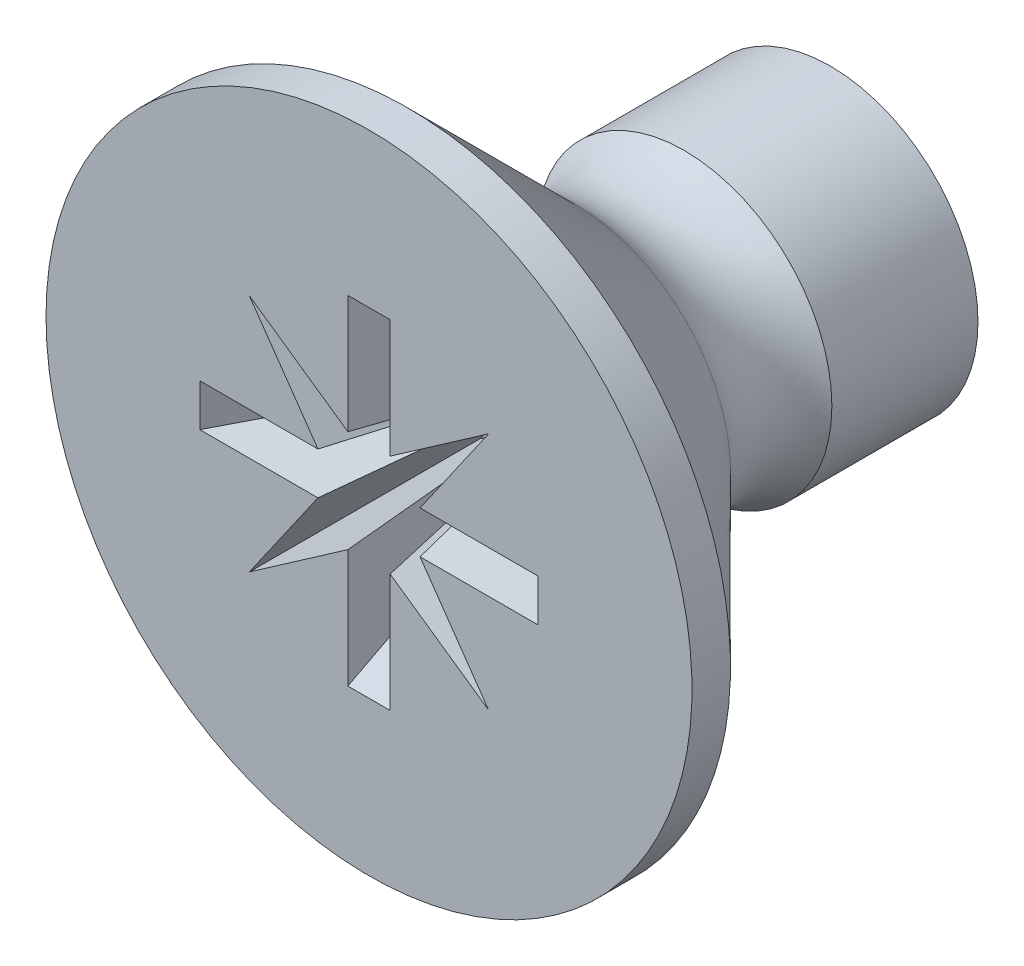
ISO-10303-21;
HEADER;
FILE_DESCRIPTION(('STEP AP214'),'2;1');
FILE_NAME('part.step','',(''),(''),'','','');
FILE_SCHEMA(('AUTOMOTIVE_DESIGN { 1 0 10303 214 1 1 1 1 }'));
ENDSEC;
DATA;
#1=APPLICATION_CONTEXT('core data for automotive mechanical design processes');
#2=APPLICATION_PROTOCOL_DEFINITION('international standard','automotive_design',2000,#1);
#3=PRODUCT_CONTEXT('',#1,'mechanical');
#4=PRODUCT('Part','Part','',(#3));
#5=PRODUCT_RELATED_PRODUCT_CATEGORY('part','',(#4));
#6=PRODUCT_DEFINITION_FORMATION('','',#4);
#7=PRODUCT_DEFINITION_CONTEXT('part definition',#1,'design');
#8=PRODUCT_DEFINITION('design','',#6,#7);
#9=PRODUCT_DEFINITION_SHAPE('','',#8);
#10=(LENGTH_UNIT() NAMED_UNIT(*) SI_UNIT(.MILLI.,.METRE.));
#11=(NAMED_UNIT(*) PLANE_ANGLE_UNIT() SI_UNIT($,.RADIAN.));
#12=(NAMED_UNIT(*) SI_UNIT($,.STERADIAN.) SOLID_ANGLE_UNIT());
#13=UNCERTAINTY_MEASURE_WITH_UNIT(LENGTH_MEASURE(1.E-05),#10,'distance_accuracy_value','');
#14=(GEOMETRIC_REPRESENTATION_CONTEXT(3) GLOBAL_UNCERTAINTY_ASSIGNED_CONTEXT((#13)) GLOBAL_UNIT_ASSIGNED_CONTEXT((#10,
#11,#12)) REPRESENTATION_CONTEXT('',''));
#15=CARTESIAN_POINT('',(0.,0.,0.));
#16=DIRECTION('',(0.,0.,1.));
#17=DIRECTION('',(1.,0.,0.));
#18=AXIS2_PLACEMENT_3D('',#15,#16,#17);
#19=CARTESIAN_POINT('',(0.,0.,-3.44586438335778));
#20=DIRECTION('',(0.,0.,-1.));
#21=DIRECTION('',(-1.,0.,0.));
#22=AXIS2_PLACEMENT_3D('',#19,#20,#21);
#23=TOROIDAL_SURFACE('',#22,2.74648652663563,1.05481152663563);
#24=CARTESIAN_POINT('',(0.,0.,-4.1));
#25=DIRECTION('',(0.,0.,-1.));
#26=DIRECTION('',(-1.,0.,0.));
#27=AXIS2_PLACEMENT_3D('',#24,#25,#26);
#28=CIRCLE('',#27,1.919);
#29=CARTESIAN_POINT('',(-1.919,0.,-4.1));
#30=VERTEX_POINT('',#29);
#31=EDGE_CURVE('E11',#30,#30,#28,.T.);
#32=ORIENTED_EDGE('',*,*,#31,.F.);
#33=EDGE_LOOP('',(#32));
#34=FACE_BOUND('',#33,.T.);
#35=CARTESIAN_POINT('',(0.,0.,-2.7));
#36=DIRECTION('',(0.,0.,-1.));
#37=DIRECTION('',(-1.,0.,0.));
#38=AXIS2_PLACEMENT_3D('',#35,#36,#37);
#39=CIRCLE('',#38,2.00062214327784);
#40=CARTESIAN_POINT('',(-2.00062214327784,0.,-2.7));
#41=VERTEX_POINT('',#40);
#42=EDGE_CURVE('E681',#41,#41,#39,.T.);
#43=ORIENTED_EDGE('',*,*,#42,.T.);
#44=EDGE_LOOP('',(#43));
#45=FACE_BOUND('',#44,.T.);
#46=ADVANCED_FACE('F17',(#34,#45),#23,.F.);
#47=CARTESIAN_POINT('',(0.,0.,0.));
#48=DIRECTION('',(0.,0.,-1.));
#49=DIRECTION('',(-1.,0.,0.));
#50=AXIS2_PLACEMENT_3D('',#47,#48,#49);
#51=CYLINDRICAL_SURFACE('',#50,1.919);
#52=CARTESIAN_POINT('',(0.,0.,-6.));
#53=DIRECTION('',(0.,0.,-1.));
#54=DIRECTION('',(-1.,0.,0.));
#55=AXIS2_PLACEMENT_3D('',#52,#53,#54);
#56=CIRCLE('',#55,1.919);
#57=CARTESIAN_POINT('',(-1.919,0.,-6.));
#58=VERTEX_POINT('',#57);
#59=EDGE_CURVE('E27',#58,#58,#56,.T.);
#60=ORIENTED_EDGE('',*,*,#59,.F.);
#61=EDGE_LOOP('',(#60));
#62=FACE_BOUND('',#61,.T.);
#63=ORIENTED_EDGE('',*,*,#31,.T.);
#64=EDGE_LOOP('',(#63));
#65=FACE_BOUND('',#64,.T.);
#66=ADVANCED_FACE('F671',(#62,#65),#51,.T.);
#67=CARTESIAN_POINT('',(0.,1.919,-6.));
#68=DIRECTION('',(0.,0.,1.));
#69=DIRECTION('',(1.,0.,0.));
#70=AXIS2_PLACEMENT_3D('',#67,#68,#69);
#71=PLANE('',#70);
#72=ORIENTED_EDGE('',*,*,#59,.T.);
#73=EDGE_LOOP('',(#72));
#74=FACE_BOUND('',#73,.T.);
#75=ADVANCED_FACE('F257',(#74),#71,.F.);
#76=CARTESIAN_POINT('',(0.,0.,0.));
#77=DIRECTION('',(0.,0.,-1.));
#78=DIRECTION('',(-1.,0.,0.));
#79=AXIS2_PLACEMENT_3D('',#76,#77,#78);
#80=PLANE('',#79);
#81=DIRECTION('',(0.,-1.,0.));
#82=VECTOR('',#81,1.);
#83=CARTESIAN_POINT('',(0.275,-1.4319543648263,0.));
#84=LINE('',#83,#82);
#85=CARTESIAN_POINT('',(0.275,-0.663908729652601,0.));
#86=VERTEX_POINT('',#85);
#87=CARTESIAN_POINT('',(0.275,-2.2,0.));
#88=VERTEX_POINT('',#87);
#89=EDGE_CURVE('E177',#86,#88,#84,.T.);
#90=ORIENTED_EDGE('',*,*,#89,.T.);
#91=DIRECTION('',(-1.,0.,0.));
#92=VECTOR('',#91,1.);
#93=CARTESIAN_POINT('',(-0.1375,-2.2,0.));
#94=LINE('',#93,#92);
#95=CARTESIAN_POINT('',(-0.275,-2.2,0.));
#96=VERTEX_POINT('',#95);
#97=EDGE_CURVE('E167',#88,#96,#94,.T.);
#98=ORIENTED_EDGE('',*,*,#97,.T.);
#99=DIRECTION('',(0.,1.,0.));
#100=VECTOR('',#99,1.);
#101=CARTESIAN_POINT('',(-0.275,-1.4319543648263,0.));
#102=LINE('',#101,#100);
#103=CARTESIAN_POINT('',(-0.275,-0.663908729652601,0.));
#104=VERTEX_POINT('',#103);
#105=EDGE_CURVE('E41',#96,#104,#102,.T.);
#106=ORIENTED_EDGE('',*,*,#105,.T.);
#107=CARTESIAN_POINT('',(-1.55563491861041,-1.55563491861041,0.));
#108=CARTESIAN_POINT('',(-0.275,-0.663908729652601,0.));
#109=B_SPLINE_CURVE_WITH_KNOTS('',1,(#107,#108),.UNSPECIFIED.,.F.,.F.,(2,2),(0.,1.),.UNSPECIFIED.);
#110=CARTESIAN_POINT('',(-1.55563491861041,-1.55563491861041,0.));
#111=VERTEX_POINT('',#110);
#112=EDGE_CURVE('E527',#111,#104,#109,.T.);
#113=ORIENTED_EDGE('',*,*,#112,.F.);
#114=CARTESIAN_POINT('',(-0.663908729652601,-0.275,0.));
#115=CARTESIAN_POINT('',(-1.55563491861041,-1.55563491861041,0.));
#116=B_SPLINE_CURVE_WITH_KNOTS('',1,(#114,#115),.UNSPECIFIED.,.F.,.F.,(2,2),(0.,1.),.UNSPECIFIED.);
#117=CARTESIAN_POINT('',(-0.663908729652601,-0.275,0.));
#118=VERTEX_POINT('',#117);
#119=EDGE_CURVE('E546',#118,#111,#116,.T.);
#120=ORIENTED_EDGE('',*,*,#119,.F.);
#121=DIRECTION('',(-1.,0.,0.));
#122=VECTOR('',#121,1.);
#123=CARTESIAN_POINT('',(-1.4319543648263,-0.275,0.));
#124=LINE('',#123,#122);
#125=CARTESIAN_POINT('',(-2.2,-0.275,0.));
#126=VERTEX_POINT('',#125);
#127=EDGE_CURVE('E549',#118,#126,#124,.T.);
#128=ORIENTED_EDGE('',*,*,#127,.T.);
#129=DIRECTION('',(0.,1.,0.));
#130=VECTOR('',#129,1.);
#131=CARTESIAN_POINT('',(-2.2,-0.1375,0.));
#132=LINE('',#131,#130);
#133=CARTESIAN_POINT('',(-2.2,0.275,0.));
#134=VERTEX_POINT('',#133);
#135=EDGE_CURVE('E565',#126,#134,#132,.T.);
#136=ORIENTED_EDGE('',*,*,#135,.T.);
#137=DIRECTION('',(1.,0.,0.));
#138=VECTOR('',#137,1.);
#139=CARTESIAN_POINT('',(-1.4319543648263,0.275,0.));
#140=LINE('',#139,#138);
#141=CARTESIAN_POINT('',(-0.663908729652601,0.275,0.));
#142=VERTEX_POINT('',#141);
#143=EDGE_CURVE('E588',#134,#142,#140,.T.);
#144=ORIENTED_EDGE('',*,*,#143,.T.);
#145=CARTESIAN_POINT('',(-1.55563491861041,1.55563491861041,0.));
#146=CARTESIAN_POINT('',(-0.663908729652601,0.275,0.));
#147=B_SPLINE_CURVE_WITH_KNOTS('',1,(#145,#146),.UNSPECIFIED.,.F.,.F.,(2,2),(0.,1.),.UNSPECIFIED.);
#148=CARTESIAN_POINT('',(-1.55563491861041,1.55563491861041,0.));
#149=VERTEX_POINT('',#148);
#150=EDGE_CURVE('E596',#149,#142,#147,.T.);
#151=ORIENTED_EDGE('',*,*,#150,.F.);
#152=CARTESIAN_POINT('',(-0.275,0.663908729652601,0.));
#153=CARTESIAN_POINT('',(-1.55563491861041,1.55563491861041,0.));
#154=B_SPLINE_CURVE_WITH_KNOTS('',1,(#152,#153),.UNSPECIFIED.,.F.,.F.,(2,2),(0.,1.),.UNSPECIFIED.);
#155=CARTESIAN_POINT('',(-0.275,0.663908729652601,0.));
#156=VERTEX_POINT('',#155);
#157=EDGE_CURVE('E609',#156,#149,#154,.T.);
#158=ORIENTED_EDGE('',*,*,#157,.F.);
#159=DIRECTION('',(0.,1.,0.));
#160=VECTOR('',#159,1.);
#161=CARTESIAN_POINT('',(-0.275,1.4319543648263,0.));
#162=LINE('',#161,#160);
#163=CARTESIAN_POINT('',(-0.275,2.2,0.));
#164=VERTEX_POINT('',#163);
#165=EDGE_CURVE('E612',#156,#164,#162,.T.);
#166=ORIENTED_EDGE('',*,*,#165,.T.);
#167=DIRECTION('',(1.,0.,0.));
#168=VECTOR('',#167,1.);
#169=CARTESIAN_POINT('',(-0.1375,2.2,0.));
#170=LINE('',#169,#168);
#171=CARTESIAN_POINT('',(0.275,2.2,0.));
#172=VERTEX_POINT('',#171);
#173=EDGE_CURVE('E629',#164,#172,#170,.T.);
#174=ORIENTED_EDGE('',*,*,#173,.T.);
#175=DIRECTION('',(0.,-1.,0.));
#176=VECTOR('',#175,1.);
#177=CARTESIAN_POINT('',(0.275,1.4319543648263,0.));
#178=LINE('',#177,#176);
#179=CARTESIAN_POINT('',(0.275,0.663908729652601,0.));
#180=VERTEX_POINT('',#179);
#181=EDGE_CURVE('E326',#172,#180,#178,.T.);
#182=ORIENTED_EDGE('',*,*,#181,.T.);
#183=CARTESIAN_POINT('',(1.55563491861041,1.55563491861041,0.));
#184=CARTESIAN_POINT('',(0.275,0.663908729652601,0.));
#185=B_SPLINE_CURVE_WITH_KNOTS('',1,(#183,#184),.UNSPECIFIED.,.F.,.F.,(2,2),(0.,1.),.UNSPECIFIED.);
#186=CARTESIAN_POINT('',(1.55563491861041,1.55563491861041,0.));
#187=VERTEX_POINT('',#186);
#188=EDGE_CURVE('E303',#187,#180,#185,.T.);
#189=ORIENTED_EDGE('',*,*,#188,.F.);
#190=CARTESIAN_POINT('',(0.663908729652601,0.275,0.));
#191=CARTESIAN_POINT('',(1.55563491861041,1.55563491861041,0.));
#192=B_SPLINE_CURVE_WITH_KNOTS('',1,(#190,#191),.UNSPECIFIED.,.F.,.F.,(2,2),(0.,1.),.UNSPECIFIED.);
#193=CARTESIAN_POINT('',(0.663908729652601,0.275,0.));
#194=VERTEX_POINT('',#193);
#195=EDGE_CURVE('E297',#194,#187,#192,.T.);
#196=ORIENTED_EDGE('',*,*,#195,.F.);
#197=DIRECTION('',(1.,0.,0.));
#198=VECTOR('',#197,1.);
#199=CARTESIAN_POINT('',(1.4319543648263,0.275,0.));
#200=LINE('',#199,#198);
#201=CARTESIAN_POINT('',(2.2,0.275,0.));
#202=VERTEX_POINT('',#201);
#203=EDGE_CURVE('E300',#194,#202,#200,.T.);
#204=ORIENTED_EDGE('',*,*,#203,.T.);
#205=DIRECTION('',(0.,-1.,0.));
#206=VECTOR('',#205,1.);
#207=CARTESIAN_POINT('',(2.2,0.1375,0.));
#208=LINE('',#207,#206);
#209=CARTESIAN_POINT('',(2.2,-0.275,0.));
#210=VERTEX_POINT('',#209);
#211=EDGE_CURVE('E497',#202,#210,#208,.T.);
#212=ORIENTED_EDGE('',*,*,#211,.T.);
#213=DIRECTION('',(-1.,0.,0.));
#214=VECTOR('',#213,1.);
#215=CARTESIAN_POINT('',(1.4319543648263,-0.275,0.));
#216=LINE('',#215,#214);
#217=CARTESIAN_POINT('',(0.663908729652601,-0.275,0.));
#218=VERTEX_POINT('',#217);
#219=EDGE_CURVE('E468',#210,#218,#216,.T.);
#220=ORIENTED_EDGE('',*,*,#219,.T.);
#221=CARTESIAN_POINT('',(1.55563491861041,-1.55563491861041,0.));
#222=CARTESIAN_POINT('',(0.663908729652601,-0.275,0.));
#223=B_SPLINE_CURVE_WITH_KNOTS('',1,(#221,#222),.UNSPECIFIED.,.F.,.F.,(2,2),(0.,1.),.UNSPECIFIED.);
#224=CARTESIAN_POINT('',(1.55563491861041,-1.55563491861041,0.));
#225=VERTEX_POINT('',#224);
#226=EDGE_CURVE('E236',#225,#218,#223,.T.);
#227=ORIENTED_EDGE('',*,*,#226,.F.);
#228=CARTESIAN_POINT('',(0.275,-0.663908729652601,0.));
#229=CARTESIAN_POINT('',(1.55563491861041,-1.55563491861041,0.));
#230=B_SPLINE_CURVE_WITH_KNOTS('',1,(#228,#229),.UNSPECIFIED.,.F.,.F.,(2,2),(0.,1.),.UNSPECIFIED.);
#231=EDGE_CURVE('E194',#86,#225,#230,.T.);
#232=ORIENTED_EDGE('',*,*,#231,.F.);
#233=EDGE_LOOP('',(#90,#98,#106,#113,#120,#128,#136,#144,#151,#158,#166,#174,#182,#189,#196,
#204,#212,#220,#227,#232));
#234=FACE_BOUND('',#233,.T.);
#235=CARTESIAN_POINT('',(0.,0.,0.));
#236=DIRECTION('',(0.,0.,-1.));
#237=DIRECTION('',(-1.,0.,0.));
#238=AXIS2_PLACEMENT_3D('',#235,#236,#237);
#239=CIRCLE('',#238,4.2);
#240=CARTESIAN_POINT('',(-4.2,0.,0.));
#241=VERTEX_POINT('',#240);
#242=EDGE_CURVE('E686',#241,#241,#239,.T.);
#243=ORIENTED_EDGE('',*,*,#242,.F.);
#244=EDGE_LOOP('',(#243));
#245=FACE_BOUND('',#244,.T.);
#246=ADVANCED_FACE('F238',(#234,#245),#80,.F.);
#247=CARTESIAN_POINT('',(0.,0.,0.));
#248=DIRECTION('',(0.,0.,-1.));
#249=DIRECTION('',(-1.,0.,0.));
#250=AXIS2_PLACEMENT_3D('',#247,#248,#249);
#251=CYLINDRICAL_SURFACE('',#250,4.2);
#252=CARTESIAN_POINT('',(0.,0.,-0.50062214327793));
#253=DIRECTION('',(0.,0.,-1.));
#254=DIRECTION('',(-1.,0.,0.));
#255=AXIS2_PLACEMENT_3D('',#252,#253,#254);
#256=CIRCLE('',#255,4.2);
#257=CARTESIAN_POINT('',(-4.2,0.,-0.50062214327793));
#258=VERTEX_POINT('',#257);
#259=EDGE_CURVE('E683',#258,#258,#256,.T.);
#260=ORIENTED_EDGE('',*,*,#259,.F.);
#261=EDGE_LOOP('',(#260));
#262=FACE_BOUND('',#261,.T.);
#263=ORIENTED_EDGE('',*,*,#242,.T.);
#264=EDGE_LOOP('',(#263));
#265=FACE_BOUND('',#264,.T.);
#266=ADVANCED_FACE('F256',(#262,#265),#251,.T.);
#267=CARTESIAN_POINT('',(0.,0.,-0.50062214327793));
#268=DIRECTION('',(0.,0.,1.));
#269=DIRECTION('',(1.,0.,0.));
#270=AXIS2_PLACEMENT_3D('',#267,#268,#269);
#271=CONICAL_SURFACE('',#270,4.2,0.785398163397469);
#272=ORIENTED_EDGE('',*,*,#42,.F.);
#273=EDGE_LOOP('',(#272));
#274=FACE_BOUND('',#273,.T.);
#275=ORIENTED_EDGE('',*,*,#259,.T.);
#276=EDGE_LOOP('',(#275));
#277=FACE_BOUND('',#276,.T.);
#278=ADVANCED_FACE('F832',(#274,#277),#271,.T.);
#279=CARTESIAN_POINT('',(0.1925,-1.54,-1.03));
#280=DIRECTION('',(-0.996807580937928,0.,0.0798413839100766));
#281=DIRECTION('',(0.0798413839100766,0.,0.996807580937928));
#282=AXIS2_PLACEMENT_3D('',#279,#280,#281);
#283=PLANE('',#282);
#284=CARTESIAN_POINT('',(0.11,-0.265563491861041,-2.06));
#285=CARTESIAN_POINT('',(0.275,-0.663908729652601,0.));
#286=B_SPLINE_CURVE_WITH_KNOTS('',1,(#284,#285),.UNSPECIFIED.,.F.,.F.,(2,2),(0.,1.),.UNSPECIFIED.);
#287=CARTESIAN_POINT('',(0.11,-0.265563491861041,-2.06));
#288=VERTEX_POINT('',#287);
#289=EDGE_CURVE('E180',#288,#86,#286,.T.);
#290=ORIENTED_EDGE('',*,*,#289,.F.);
#291=DIRECTION('',(0.,-1.,0.));
#292=VECTOR('',#291,1.);
#293=CARTESIAN_POINT('',(0.11,-0.57278174593052,-2.06));
#294=LINE('',#293,#292);
#295=CARTESIAN_POINT('',(0.11,-0.88,-2.06));
#296=VERTEX_POINT('',#295);
#297=EDGE_CURVE('E163',#288,#296,#294,.T.);
#298=ORIENTED_EDGE('',*,*,#297,.T.);
#299=DIRECTION('',(0.0672868530251848,-0.538294824201477,0.8400661650417));
#300=VECTOR('',#299,1.);
#301=CARTESIAN_POINT('',(0.1925,-1.54,-1.03));
#302=LINE('',#301,#300);
#303=EDGE_CURVE('E171',#296,#88,#302,.T.);
#304=ORIENTED_EDGE('',*,*,#303,.T.);
#305=ORIENTED_EDGE('',*,*,#89,.F.);
#306=EDGE_LOOP('',(#290,#298,#304,#305));
#307=FACE_BOUND('',#306,.T.);
#308=ADVANCED_FACE('F179',(#307),#283,.T.);
#309=CARTESIAN_POINT('',(0.615234797466006,-0.615234797466006,-2.06));
#310=CARTESIAN_POINT('',(1.55563491861041,-1.55563491861041,0.));
#311=CARTESIAN_POINT('',(0.11,-0.265563491861041,-2.06));
#312=CARTESIAN_POINT('',(0.275,-0.663908729652601,0.));
#313=B_SPLINE_SURFACE_WITH_KNOTS('',1,1,((#309,#310),(#311,#312)),.UNSPECIFIED.,.F.,.F.,.F.,(2,
2),(2,2),(0.,1.),(0.,1.),.UNSPECIFIED.);
#314=CARTESIAN_POINT('',(0.615234797466006,-0.615234797466006,-2.06));
#315=CARTESIAN_POINT('',(0.11,-0.265563491861041,-2.06));
#316=B_SPLINE_CURVE_WITH_KNOTS('',1,(#314,#315),.UNSPECIFIED.,.F.,.F.,(2,2),(0.,1.),.UNSPECIFIED.);
#317=CARTESIAN_POINT('',(0.615234797466006,-0.615234797466006,-2.06));
#318=VERTEX_POINT('',#317);
#319=EDGE_CURVE('E235',#318,#288,#316,.T.);
#320=CARTESIAN_POINT('',(0.615234797466006,-0.615234797466006,-2.06));
#321=CARTESIAN_POINT('',(1.55563491861041,-1.55563491861041,0.));
#322=B_SPLINE_CURVE_WITH_KNOTS('',1,(#320,#321),.UNSPECIFIED.,.F.,.F.,(2,2),(0.,1.),.UNSPECIFIED.);
#323=EDGE_CURVE('E476',#318,#225,#322,.T.);
#324=ORIENTED_EDGE('',*,*,#319,.T.);
#325=ORIENTED_EDGE('',*,*,#289,.T.);
#326=ORIENTED_EDGE('',*,*,#231,.T.);
#327=ORIENTED_EDGE('',*,*,#323,.F.);
#328=EDGE_LOOP('',(#324,#325,#326,#327));
#329=FACE_BOUND('',#328,.T.);
#330=ADVANCED_FACE('F201',(#329),#313,.T.);
#331=CARTESIAN_POINT('',(0.265563491861041,-0.11,-2.06));
#332=CARTESIAN_POINT('',(0.663908729652601,-0.275,0.));
#333=CARTESIAN_POINT('',(0.615234797466006,-0.615234797466006,-2.06));
#334=CARTESIAN_POINT('',(1.55563491861041,-1.55563491861041,0.));
#335=B_SPLINE_SURFACE_WITH_KNOTS('',1,1,((#331,#332),(#333,#334)),.UNSPECIFIED.,.F.,.F.,.F.,(2,
2),(2,2),(0.,1.),(0.,1.),.UNSPECIFIED.);
#336=CARTESIAN_POINT('',(0.265563491861041,-0.11,-2.06));
#337=CARTESIAN_POINT('',(0.615234797466006,-0.615234797466006,-2.06));
#338=B_SPLINE_CURVE_WITH_KNOTS('',1,(#336,#337),.UNSPECIFIED.,.F.,.F.,(2,2),(0.,1.),.UNSPECIFIED.);
#339=CARTESIAN_POINT('',(0.265563491861041,-0.11,-2.06));
#340=VERTEX_POINT('',#339);
#341=EDGE_CURVE('E457',#340,#318,#338,.T.);
#342=DIRECTION('',(0.189270131540883,-0.0783982554363736,0.978790340599574));
#343=VECTOR('',#342,1.);
#344=CARTESIAN_POINT('',(0.464736110756821,-0.1925,-1.03));
#345=LINE('',#344,#343);
#346=EDGE_CURVE('E461',#340,#218,#345,.T.);
#347=ORIENTED_EDGE('',*,*,#341,.T.);
#348=ORIENTED_EDGE('',*,*,#323,.T.);
#349=ORIENTED_EDGE('',*,*,#226,.T.);
#350=ORIENTED_EDGE('',*,*,#346,.F.);
#351=EDGE_LOOP('',(#347,#348,#349,#350));
#352=FACE_BOUND('',#351,.T.);
#353=ADVANCED_FACE('F213',(#352),#335,.T.);
#354=CARTESIAN_POINT('',(1.54,-0.1925,-1.03));
#355=DIRECTION('',(0.,0.996807580937928,0.0798413839100764));
#356=DIRECTION('',(0.,-0.0798413839100765,0.996807580937928));
#357=AXIS2_PLACEMENT_3D('',#354,#355,#356);
#358=PLANE('',#357);
#359=DIRECTION('',(0.538294824201477,-0.0672868530251851,0.840066165041699));
#360=VECTOR('',#359,1.);
#361=CARTESIAN_POINT('',(1.54,-0.1925,-1.03));
#362=LINE('',#361,#360);
#363=CARTESIAN_POINT('',(0.88,-0.11,-2.06));
#364=VERTEX_POINT('',#363);
#365=EDGE_CURVE('E500',#364,#210,#362,.T.);
#366=ORIENTED_EDGE('',*,*,#365,.F.);
#367=DIRECTION('',(-1.,0.,0.));
#368=VECTOR('',#367,1.);
#369=CARTESIAN_POINT('',(0.57278174593052,-0.11,-2.06));
#370=LINE('',#369,#368);
#371=EDGE_CURVE('E469',#364,#340,#370,.T.);
#372=ORIENTED_EDGE('',*,*,#371,.T.);
#373=ORIENTED_EDGE('',*,*,#346,.T.);
#374=ORIENTED_EDGE('',*,*,#219,.F.);
#375=EDGE_LOOP('',(#366,#372,#373,#374));
#376=FACE_BOUND('',#375,.T.);
#377=ADVANCED_FACE('F803',(#376),#358,.T.);
#378=CARTESIAN_POINT('',(1.54,0.1925,-1.03));
#379=DIRECTION('',(-0.841974355450063,0.,0.539517548152468));
#380=DIRECTION('',(0.539517548152468,0.,0.841974355450063));
#381=AXIS2_PLACEMENT_3D('',#378,#379,#380);
#382=PLANE('',#381);
#383=DIRECTION('',(0.538294824201477,0.0672868530251851,0.840066165041699));
#384=VECTOR('',#383,1.);
#385=CARTESIAN_POINT('',(1.54,0.1925,-1.03));
#386=LINE('',#385,#384);
#387=CARTESIAN_POINT('',(0.88,0.11,-2.06));
#388=VERTEX_POINT('',#387);
#389=EDGE_CURVE('E309',#388,#202,#386,.T.);
#390=ORIENTED_EDGE('',*,*,#389,.F.);
#391=DIRECTION('',(0.,-1.,0.));
#392=VECTOR('',#391,1.);
#393=CARTESIAN_POINT('',(0.88,0.055,-2.06));
#394=LINE('',#393,#392);
#395=EDGE_CURVE('E502',#388,#364,#394,.T.);
#396=ORIENTED_EDGE('',*,*,#395,.T.);
#397=ORIENTED_EDGE('',*,*,#365,.T.);
#398=ORIENTED_EDGE('',*,*,#211,.F.);
#399=EDGE_LOOP('',(#390,#396,#397,#398));
#400=FACE_BOUND('',#399,.T.);
#401=ADVANCED_FACE('F669',(#400),#382,.T.);
#402=CARTESIAN_POINT('',(1.54,0.1925,-1.03));
#403=DIRECTION('',(0.,-0.996807580937928,0.0798413839100765));
#404=DIRECTION('',(0.,-0.0798413839100765,-0.996807580937928));
#405=AXIS2_PLACEMENT_3D('',#402,#403,#404);
#406=PLANE('',#405);
#407=CARTESIAN_POINT('',(0.265563491861041,0.11,-2.06));
#408=CARTESIAN_POINT('',(0.663908729652601,0.275,0.));
#409=B_SPLINE_CURVE_WITH_KNOTS('',1,(#407,#408),.UNSPECIFIED.,.F.,.F.,(2,2),(0.,1.),.UNSPECIFIED.);
#410=CARTESIAN_POINT('',(0.265563491861041,0.11,-2.06));
#411=VERTEX_POINT('',#410);
#412=EDGE_CURVE('E306',#411,#194,#409,.T.);
#413=ORIENTED_EDGE('',*,*,#412,.F.);
#414=DIRECTION('',(1.,0.,0.));
#415=VECTOR('',#414,1.);
#416=CARTESIAN_POINT('',(0.57278174593052,0.11,-2.06));
#417=LINE('',#416,#415);
#418=EDGE_CURVE('E311',#411,#388,#417,.T.);
#419=ORIENTED_EDGE('',*,*,#418,.T.);
#420=ORIENTED_EDGE('',*,*,#389,.T.);
#421=ORIENTED_EDGE('',*,*,#203,.F.);
#422=EDGE_LOOP('',(#413,#419,#420,#421));
#423=FACE_BOUND('',#422,.T.);
#424=ADVANCED_FACE('F662',(#423),#406,.T.);
#425=CARTESIAN_POINT('',(0.615234797466006,0.615234797466006,-2.06));
#426=CARTESIAN_POINT('',(1.55563491861041,1.55563491861041,0.));
#427=CARTESIAN_POINT('',(0.265563491861041,0.11,-2.06));
#428=CARTESIAN_POINT('',(0.663908729652601,0.275,0.));
#429=B_SPLINE_SURFACE_WITH_KNOTS('',1,1,((#425,#426),(#427,#428)),.UNSPECIFIED.,.F.,.F.,.F.,(2,
2),(2,2),(0.,1.),(0.,1.),.UNSPECIFIED.);
#430=CARTESIAN_POINT('',(0.615234797466006,0.615234797466006,-2.06));
#431=CARTESIAN_POINT('',(0.265563491861041,0.11,-2.06));
#432=B_SPLINE_CURVE_WITH_KNOTS('',1,(#430,#431),.UNSPECIFIED.,.F.,.F.,(2,2),(0.,1.),.UNSPECIFIED.);
#433=CARTESIAN_POINT('',(0.615234797466006,0.615234797466006,-2.06));
#434=VERTEX_POINT('',#433);
#435=EDGE_CURVE('E307',#434,#411,#432,.T.);
#436=CARTESIAN_POINT('',(0.615234797466006,0.615234797466006,-2.06));
#437=CARTESIAN_POINT('',(1.55563491861041,1.55563491861041,0.));
#438=B_SPLINE_CURVE_WITH_KNOTS('',1,(#436,#437),.UNSPECIFIED.,.F.,.F.,(2,2),(0.,1.),.UNSPECIFIED.);
#439=EDGE_CURVE('E374',#434,#187,#438,.T.);
#440=ORIENTED_EDGE('',*,*,#435,.T.);
#441=ORIENTED_EDGE('',*,*,#412,.T.);
#442=ORIENTED_EDGE('',*,*,#195,.T.);
#443=ORIENTED_EDGE('',*,*,#439,.F.);
#444=EDGE_LOOP('',(#440,#441,#442,#443));
#445=FACE_BOUND('',#444,.T.);
#446=ADVANCED_FACE('F340',(#445),#429,.T.);
#447=CARTESIAN_POINT('',(0.11,0.265563491861041,-2.06));
#448=CARTESIAN_POINT('',(0.275,0.663908729652601,0.));
#449=CARTESIAN_POINT('',(0.615234797466006,0.615234797466006,-2.06));
#450=CARTESIAN_POINT('',(1.55563491861041,1.55563491861041,0.));
#451=B_SPLINE_SURFACE_WITH_KNOTS('',1,1,((#447,#448),(#449,#450)),.UNSPECIFIED.,.F.,.F.,.F.,(2,
2),(2,2),(0.,1.),(0.,1.),.UNSPECIFIED.);
#452=CARTESIAN_POINT('',(0.11,0.265563491861041,-2.06));
#453=CARTESIAN_POINT('',(0.615234797466006,0.615234797466006,-2.06));
#454=B_SPLINE_CURVE_WITH_KNOTS('',1,(#452,#453),.UNSPECIFIED.,.F.,.F.,(2,2),(0.,1.),.UNSPECIFIED.);
#455=CARTESIAN_POINT('',(0.11,0.265563491861041,-2.06));
#456=VERTEX_POINT('',#455);
#457=EDGE_CURVE('E371',#456,#434,#454,.T.);
#458=DIRECTION('',(0.0783982554363736,0.189270131540883,0.978790340599574));
#459=VECTOR('',#458,1.);
#460=CARTESIAN_POINT('',(0.1925,0.464736110756821,-1.03));
#461=LINE('',#460,#459);
#462=EDGE_CURVE('E359',#456,#180,#461,.T.);
#463=ORIENTED_EDGE('',*,*,#457,.T.);
#464=ORIENTED_EDGE('',*,*,#439,.T.);
#465=ORIENTED_EDGE('',*,*,#188,.T.);
#466=ORIENTED_EDGE('',*,*,#462,.F.);
#467=EDGE_LOOP('',(#463,#464,#465,#466));
#468=FACE_BOUND('',#467,.T.);
#469=ADVANCED_FACE('F328',(#468),#451,.T.);
#470=CARTESIAN_POINT('',(0.1925,1.54,-1.03));
#471=DIRECTION('',(-0.996807580937928,0.,0.0798413839100766));
#472=DIRECTION('',(0.0798413839100766,0.,0.996807580937928));
#473=AXIS2_PLACEMENT_3D('',#470,#471,#472);
#474=PLANE('',#473);
#475=DIRECTION('',(0.0672868530251848,0.538294824201477,0.8400661650417));
#476=VECTOR('',#475,1.);
#477=CARTESIAN_POINT('',(0.1925,1.54,-1.03));
#478=LINE('',#477,#476);
#479=CARTESIAN_POINT('',(0.11,0.88,-2.06));
#480=VERTEX_POINT('',#479);
#481=EDGE_CURVE('E636',#480,#172,#478,.T.);
#482=ORIENTED_EDGE('',*,*,#481,.F.);
#483=DIRECTION('',(0.,-1.,0.));
#484=VECTOR('',#483,1.);
#485=CARTESIAN_POINT('',(0.11,0.57278174593052,-2.06));
#486=LINE('',#485,#484);
#487=EDGE_CURVE('E366',#480,#456,#486,.T.);
#488=ORIENTED_EDGE('',*,*,#487,.T.);
#489=ORIENTED_EDGE('',*,*,#462,.T.);
#490=ORIENTED_EDGE('',*,*,#181,.F.);
#491=EDGE_LOOP('',(#482,#488,#489,#490));
#492=FACE_BOUND('',#491,.T.);
#493=ADVANCED_FACE('F339',(#492),#474,.T.);
#494=CARTESIAN_POINT('',(-0.1925,1.54,-1.03));
#495=DIRECTION('',(0.,-0.841974355450063,0.539517548152468));
#496=DIRECTION('',(0.,-0.539517548152468,-0.841974355450063));
#497=AXIS2_PLACEMENT_3D('',#494,#495,#496);
#498=PLANE('',#497);
#499=DIRECTION('',(-0.0672868530251848,0.538294824201477,0.8400661650417));
#500=VECTOR('',#499,1.);
#501=CARTESIAN_POINT('',(-0.1925,1.54,-1.03));
#502=LINE('',#501,#500);
#503=CARTESIAN_POINT('',(-0.11,0.88,-2.06));
#504=VERTEX_POINT('',#503);
#505=EDGE_CURVE('E628',#504,#164,#502,.T.);
#506=ORIENTED_EDGE('',*,*,#505,.F.);
#507=DIRECTION('',(1.,0.,0.));
#508=VECTOR('',#507,1.);
#509=CARTESIAN_POINT('',(-0.055,0.88,-2.06));
#510=LINE('',#509,#508);
#511=EDGE_CURVE('E640',#504,#480,#510,.T.);
#512=ORIENTED_EDGE('',*,*,#511,.T.);
#513=ORIENTED_EDGE('',*,*,#481,.T.);
#514=ORIENTED_EDGE('',*,*,#173,.F.);
#515=EDGE_LOOP('',(#506,#512,#513,#514));
#516=FACE_BOUND('',#515,.T.);
#517=ADVANCED_FACE('F732',(#516),#498,.T.);
#518=CARTESIAN_POINT('',(-0.1925,1.54,-1.03));
#519=DIRECTION('',(0.996807580937928,0.,0.0798413839100766));
#520=DIRECTION('',(0.0798413839100766,0.,-0.996807580937928));
#521=AXIS2_PLACEMENT_3D('',#518,#519,#520);
#522=PLANE('',#521);
#523=CARTESIAN_POINT('',(-0.11,0.265563491861041,-2.06));
#524=CARTESIAN_POINT('',(-0.275,0.663908729652601,0.));
#525=B_SPLINE_CURVE_WITH_KNOTS('',1,(#523,#524),.UNSPECIFIED.,.F.,.F.,(2,2),(0.,1.),.UNSPECIFIED.);
#526=CARTESIAN_POINT('',(-0.11,0.265563491861041,-2.06));
#527=VERTEX_POINT('',#526);
#528=EDGE_CURVE('E607',#527,#156,#525,.T.);
#529=ORIENTED_EDGE('',*,*,#528,.F.);
#530=DIRECTION('',(0.,1.,0.));
#531=VECTOR('',#530,1.);
#532=CARTESIAN_POINT('',(-0.11,0.57278174593052,-2.06));
#533=LINE('',#532,#531);
#534=EDGE_CURVE('E622',#527,#504,#533,.T.);
#535=ORIENTED_EDGE('',*,*,#534,.T.);
#536=ORIENTED_EDGE('',*,*,#505,.T.);
#537=ORIENTED_EDGE('',*,*,#165,.F.);
#538=EDGE_LOOP('',(#529,#535,#536,#537));
#539=FACE_BOUND('',#538,.T.);
#540=ADVANCED_FACE('F734',(#539),#522,.T.);
#541=CARTESIAN_POINT('',(-0.615234797466006,0.615234797466006,-2.06));
#542=CARTESIAN_POINT('',(-1.55563491861041,1.55563491861041,0.));
#543=CARTESIAN_POINT('',(-0.11,0.265563491861041,-2.06));
#544=CARTESIAN_POINT('',(-0.275,0.663908729652601,0.));
#545=B_SPLINE_SURFACE_WITH_KNOTS('',1,1,((#541,#542),(#543,#544)),.UNSPECIFIED.,.F.,.F.,.F.,(2,
2),(2,2),(0.,1.),(0.,1.),.UNSPECIFIED.);
#546=CARTESIAN_POINT('',(-0.615234797466006,0.615234797466006,-2.06));
#547=CARTESIAN_POINT('',(-0.11,0.265563491861041,-2.06));
#548=B_SPLINE_CURVE_WITH_KNOTS('',1,(#546,#547),.UNSPECIFIED.,.F.,.F.,(2,2),(0.,1.),.UNSPECIFIED.);
#549=CARTESIAN_POINT('',(-0.615234797466006,0.615234797466006,-2.06));
#550=VERTEX_POINT('',#549);
#551=EDGE_CURVE('E577',#550,#527,#548,.T.);
#552=CARTESIAN_POINT('',(-0.615234797466006,0.615234797466006,-2.06));
#553=CARTESIAN_POINT('',(-1.55563491861041,1.55563491861041,0.));
#554=B_SPLINE_CURVE_WITH_KNOTS('',1,(#552,#553),.UNSPECIFIED.,.F.,.F.,(2,2),(0.,1.),.UNSPECIFIED.);
#555=EDGE_CURVE('E579',#550,#149,#554,.T.);
#556=ORIENTED_EDGE('',*,*,#551,.T.);
#557=ORIENTED_EDGE('',*,*,#528,.T.);
#558=ORIENTED_EDGE('',*,*,#157,.T.);
#559=ORIENTED_EDGE('',*,*,#555,.F.);
#560=EDGE_LOOP('',(#556,#557,#558,#559));
#561=FACE_BOUND('',#560,.T.);
#562=ADVANCED_FACE('F737',(#561),#545,.T.);
#563=CARTESIAN_POINT('',(-0.265563491861041,0.11,-2.06));
#564=CARTESIAN_POINT('',(-0.663908729652601,0.275,0.));
#565=CARTESIAN_POINT('',(-0.615234797466006,0.615234797466006,-2.06));
#566=CARTESIAN_POINT('',(-1.55563491861041,1.55563491861041,0.));
#567=B_SPLINE_SURFACE_WITH_KNOTS('',1,1,((#563,#564),(#565,#566)),.UNSPECIFIED.,.F.,.F.,.F.,(2,
2),(2,2),(0.,1.),(0.,1.),.UNSPECIFIED.);
#568=CARTESIAN_POINT('',(-0.265563491861041,0.11,-2.06));
#569=CARTESIAN_POINT('',(-0.615234797466006,0.615234797466006,-2.06));
#570=B_SPLINE_CURVE_WITH_KNOTS('',1,(#568,#569),.UNSPECIFIED.,.F.,.F.,(2,2),(0.,1.),.UNSPECIFIED.);
#571=CARTESIAN_POINT('',(-0.265563491861041,0.11,-2.06));
#572=VERTEX_POINT('',#571);
#573=EDGE_CURVE('E571',#572,#550,#570,.T.);
#574=DIRECTION('',(-0.189270131540883,0.0783982554363736,0.978790340599574));
#575=VECTOR('',#574,1.);
#576=CARTESIAN_POINT('',(-0.464736110756821,0.1925,-1.03));
#577=LINE('',#576,#575);
#578=EDGE_CURVE('E584',#572,#142,#577,.T.);
#579=ORIENTED_EDGE('',*,*,#573,.T.);
#580=ORIENTED_EDGE('',*,*,#555,.T.);
#581=ORIENTED_EDGE('',*,*,#150,.T.);
#582=ORIENTED_EDGE('',*,*,#578,.F.);
#583=EDGE_LOOP('',(#579,#580,#581,#582));
#584=FACE_BOUND('',#583,.T.);
#585=ADVANCED_FACE('F754',(#584),#567,.T.);
#586=CARTESIAN_POINT('',(-1.54,0.1925,-1.03));
#587=DIRECTION('',(0.,-0.996807580937928,0.0798413839100764));
#588=DIRECTION('',(0.,-0.0798413839100765,-0.996807580937928));
#589=AXIS2_PLACEMENT_3D('',#586,#587,#588);
#590=PLANE('',#589);
#591=DIRECTION('',(-0.538294824201477,0.0672868530251851,0.840066165041699));
#592=VECTOR('',#591,1.);
#593=CARTESIAN_POINT('',(-1.54,0.1925,-1.03));
#594=LINE('',#593,#592);
#595=CARTESIAN_POINT('',(-0.88,0.11,-2.06));
#596=VERTEX_POINT('',#595);
#597=EDGE_CURVE('E586',#596,#134,#594,.T.);
#598=ORIENTED_EDGE('',*,*,#597,.F.);
#599=DIRECTION('',(1.,0.,0.));
#600=VECTOR('',#599,1.);
#601=CARTESIAN_POINT('',(-0.57278174593052,0.11,-2.06));
#602=LINE('',#601,#600);
#603=EDGE_CURVE('E574',#596,#572,#602,.T.);
#604=ORIENTED_EDGE('',*,*,#603,.T.);
#605=ORIENTED_EDGE('',*,*,#578,.T.);
#606=ORIENTED_EDGE('',*,*,#143,.F.);
#607=EDGE_LOOP('',(#598,#604,#605,#606));
#608=FACE_BOUND('',#607,.T.);
#609=ADVANCED_FACE('F582',(#608),#590,.T.);
#610=CARTESIAN_POINT('',(-1.54,-0.1925,-1.03));
#611=DIRECTION('',(0.841974355450063,0.,0.539517548152468));
#612=DIRECTION('',(0.539517548152468,0.,-0.841974355450063));
#613=AXIS2_PLACEMENT_3D('',#610,#611,#612);
#614=PLANE('',#613);
#615=DIRECTION('',(-0.538294824201477,-0.0672868530251851,0.840066165041699));
#616=VECTOR('',#615,1.);
#617=CARTESIAN_POINT('',(-1.54,-0.1925,-1.03));
#618=LINE('',#617,#616);
#619=CARTESIAN_POINT('',(-0.88,-0.11,-2.06));
#620=VERTEX_POINT('',#619);
#621=EDGE_CURVE('E564',#620,#126,#618,.T.);
#622=ORIENTED_EDGE('',*,*,#621,.F.);
#623=DIRECTION('',(0.,1.,0.));
#624=VECTOR('',#623,1.);
#625=CARTESIAN_POINT('',(-0.88,-0.055,-2.06));
#626=LINE('',#625,#624);
#627=EDGE_CURVE('E727',#620,#596,#626,.T.);
#628=ORIENTED_EDGE('',*,*,#627,.T.);
#629=ORIENTED_EDGE('',*,*,#597,.T.);
#630=ORIENTED_EDGE('',*,*,#135,.F.);
#631=EDGE_LOOP('',(#622,#628,#629,#630));
#632=FACE_BOUND('',#631,.T.);
#633=ADVANCED_FACE('F911',(#632),#614,.T.);
#634=CARTESIAN_POINT('',(-1.54,-0.1925,-1.03));
#635=DIRECTION('',(0.,0.996807580937928,0.0798413839100765));
#636=DIRECTION('',(0.,-0.0798413839100765,0.996807580937928));
#637=AXIS2_PLACEMENT_3D('',#634,#635,#636);
#638=PLANE('',#637);
#639=CARTESIAN_POINT('',(-0.265563491861041,-0.11,-2.06));
#640=CARTESIAN_POINT('',(-0.663908729652601,-0.275,0.));
#641=B_SPLINE_CURVE_WITH_KNOTS('',1,(#639,#640),.UNSPECIFIED.,.F.,.F.,(2,2),(0.,1.),.UNSPECIFIED.);
#642=CARTESIAN_POINT('',(-0.265563491861041,-0.11,-2.06));
#643=VERTEX_POINT('',#642);
#644=EDGE_CURVE('E544',#643,#118,#641,.T.);
#645=ORIENTED_EDGE('',*,*,#644,.F.);
#646=DIRECTION('',(-1.,0.,0.));
#647=VECTOR('',#646,1.);
#648=CARTESIAN_POINT('',(-0.57278174593052,-0.11,-2.06));
#649=LINE('',#648,#647);
#650=EDGE_CURVE('E558',#643,#620,#649,.T.);
#651=ORIENTED_EDGE('',*,*,#650,.T.);
#652=ORIENTED_EDGE('',*,*,#621,.T.);
#653=ORIENTED_EDGE('',*,*,#127,.F.);
#654=EDGE_LOOP('',(#645,#651,#652,#653));
#655=FACE_BOUND('',#654,.T.);
#656=ADVANCED_FACE('F918',(#655),#638,.T.);
#657=CARTESIAN_POINT('',(-0.615234797466006,-0.615234797466006,-2.06));
#658=CARTESIAN_POINT('',(-1.55563491861041,-1.55563491861041,0.));
#659=CARTESIAN_POINT('',(-0.265563491861041,-0.11,-2.06));
#660=CARTESIAN_POINT('',(-0.663908729652601,-0.275,0.));
#661=B_SPLINE_SURFACE_WITH_KNOTS('',1,1,((#657,#658),(#659,#660)),.UNSPECIFIED.,.F.,.F.,.F.,(2,
2),(2,2),(0.,1.),(0.,1.),.UNSPECIFIED.);
#662=CARTESIAN_POINT('',(-0.615234797466006,-0.615234797466006,-2.06));
#663=CARTESIAN_POINT('',(-0.265563491861041,-0.11,-2.06));
#664=B_SPLINE_CURVE_WITH_KNOTS('',1,(#662,#663),.UNSPECIFIED.,.F.,.F.,(2,2),(0.,1.),.UNSPECIFIED.);
#665=CARTESIAN_POINT('',(-0.615234797466006,-0.615234797466006,-2.06));
#666=VERTEX_POINT('',#665);
#667=EDGE_CURVE('E519',#666,#643,#664,.T.);
#668=CARTESIAN_POINT('',(-0.615234797466006,-0.615234797466006,-2.06));
#669=CARTESIAN_POINT('',(-1.55563491861041,-1.55563491861041,0.));
#670=B_SPLINE_CURVE_WITH_KNOTS('',1,(#668,#669),.UNSPECIFIED.,.F.,.F.,(2,2),(0.,1.),.UNSPECIFIED.);
#671=EDGE_CURVE('E522',#666,#111,#670,.T.);
#672=ORIENTED_EDGE('',*,*,#667,.T.);
#673=ORIENTED_EDGE('',*,*,#644,.T.);
#674=ORIENTED_EDGE('',*,*,#119,.T.);
#675=ORIENTED_EDGE('',*,*,#671,.F.);
#676=EDGE_LOOP('',(#672,#673,#674,#675));
#677=FACE_BOUND('',#676,.T.);
#678=ADVANCED_FACE('F403',(#677),#661,.T.);
#679=CARTESIAN_POINT('',(0.,0.,-2.06));
#680=DIRECTION('',(0.,0.,-1.));
#681=DIRECTION('',(-1.,0.,0.));
#682=AXIS2_PLACEMENT_3D('',#679,#680,#681);
#683=PLANE('',#682);
#684=ORIENTED_EDGE('',*,*,#297,.F.);
#685=ORIENTED_EDGE('',*,*,#319,.F.);
#686=ORIENTED_EDGE('',*,*,#341,.F.);
#687=ORIENTED_EDGE('',*,*,#371,.F.);
#688=ORIENTED_EDGE('',*,*,#395,.F.);
#689=ORIENTED_EDGE('',*,*,#418,.F.);
#690=ORIENTED_EDGE('',*,*,#435,.F.);
#691=ORIENTED_EDGE('',*,*,#457,.F.);
#692=ORIENTED_EDGE('',*,*,#487,.F.);
#693=ORIENTED_EDGE('',*,*,#511,.F.);
#694=ORIENTED_EDGE('',*,*,#534,.F.);
#695=ORIENTED_EDGE('',*,*,#551,.F.);
#696=ORIENTED_EDGE('',*,*,#573,.F.);
#697=ORIENTED_EDGE('',*,*,#603,.F.);
#698=ORIENTED_EDGE('',*,*,#627,.F.);
#699=ORIENTED_EDGE('',*,*,#650,.F.);
#700=ORIENTED_EDGE('',*,*,#667,.F.);
#701=CARTESIAN_POINT('',(-0.11,-0.265563491861041,-2.06));
#702=CARTESIAN_POINT('',(-0.615234797466006,-0.615234797466006,-2.06));
#703=B_SPLINE_CURVE_WITH_KNOTS('',1,(#701,#702),.UNSPECIFIED.,.F.,.F.,(2,2),(0.,1.),.UNSPECIFIED.);
#704=CARTESIAN_POINT('',(-0.11,-0.265563491861041,-2.06));
#705=VERTEX_POINT('',#704);
#706=EDGE_CURVE('E168',#705,#666,#703,.T.);
#707=ORIENTED_EDGE('',*,*,#706,.F.);
#708=DIRECTION('',(0.,1.,0.));
#709=VECTOR('',#708,1.);
#710=CARTESIAN_POINT('',(-0.11,-0.57278174593052,-2.06));
#711=LINE('',#710,#709);
#712=CARTESIAN_POINT('',(-0.11,-0.88,-2.06));
#713=VERTEX_POINT('',#712);
#714=EDGE_CURVE('E165',#713,#705,#711,.T.);
#715=ORIENTED_EDGE('',*,*,#714,.F.);
#716=DIRECTION('',(-1.,0.,0.));
#717=VECTOR('',#716,1.);
#718=CARTESIAN_POINT('',(-0.055,-0.88,-2.06));
#719=LINE('',#718,#717);
#720=EDGE_CURVE('E158',#296,#713,#719,.T.);
#721=ORIENTED_EDGE('',*,*,#720,.F.);
#722=EDGE_LOOP('',(#684,#685,#686,#687,#688,#689,#690,#691,#692,#693,#694,#695,#696,#697,#698,
#699,#700,#707,#715,#721));
#723=FACE_BOUND('',#722,.T.);
#724=ADVANCED_FACE('F160',(#723),#683,.F.);
#725=CARTESIAN_POINT('',(-0.11,-0.265563491861041,-2.06));
#726=CARTESIAN_POINT('',(-0.275,-0.663908729652601,0.));
#727=CARTESIAN_POINT('',(-0.615234797466006,-0.615234797466006,-2.06));
#728=CARTESIAN_POINT('',(-1.55563491861041,-1.55563491861041,0.));
#729=B_SPLINE_SURFACE_WITH_KNOTS('',1,1,((#725,#726),(#727,#728)),.UNSPECIFIED.,.F.,.F.,.F.,(2,
2),(2,2),(0.,1.),(0.,1.),.UNSPECIFIED.);
#730=DIRECTION('',(-0.0783982554363736,-0.189270131540883,0.978790340599574));
#731=VECTOR('',#730,1.);
#732=CARTESIAN_POINT('',(-0.1925,-0.464736110756821,-1.03));
#733=LINE('',#732,#731);
#734=EDGE_CURVE('E35',#705,#104,#733,.T.);
#735=ORIENTED_EDGE('',*,*,#706,.T.);
#736=ORIENTED_EDGE('',*,*,#671,.T.);
#737=ORIENTED_EDGE('',*,*,#112,.T.);
#738=ORIENTED_EDGE('',*,*,#734,.F.);
#739=EDGE_LOOP('',(#735,#736,#737,#738));
#740=FACE_BOUND('',#739,.T.);
#741=ADVANCED_FACE('F402',(#740),#729,.T.);
#742=CARTESIAN_POINT('',(-0.1925,-1.54,-1.03));
#743=DIRECTION('',(0.,0.841974355450063,0.539517548152468));
#744=DIRECTION('',(0.,-0.539517548152468,0.841974355450063));
#745=AXIS2_PLACEMENT_3D('',#742,#743,#744);
#746=PLANE('',#745);
#747=ORIENTED_EDGE('',*,*,#720,.T.);
#748=DIRECTION('',(-0.0672868530251848,-0.538294824201477,0.8400661650417));
#749=VECTOR('',#748,1.);
#750=CARTESIAN_POINT('',(-0.1925,-1.54,-1.03));
#751=LINE('',#750,#749);
#752=EDGE_CURVE('E524',#713,#96,#751,.T.);
#753=ORIENTED_EDGE('',*,*,#752,.T.);
#754=ORIENTED_EDGE('',*,*,#97,.F.);
#755=ORIENTED_EDGE('',*,*,#303,.F.);
#756=EDGE_LOOP('',(#747,#753,#754,#755));
#757=FACE_BOUND('',#756,.T.);
#758=ADVANCED_FACE('F172',(#757),#746,.T.);
#759=CARTESIAN_POINT('',(-0.1925,-1.54,-1.03));
#760=DIRECTION('',(0.996807580937928,0.,0.0798413839100765));
#761=DIRECTION('',(0.0798413839100766,0.,-0.996807580937928));
#762=AXIS2_PLACEMENT_3D('',#759,#760,#761);
#763=PLANE('',#762);
#764=ORIENTED_EDGE('',*,*,#752,.F.);
#765=ORIENTED_EDGE('',*,*,#714,.T.);
#766=ORIENTED_EDGE('',*,*,#734,.T.);
#767=ORIENTED_EDGE('',*,*,#105,.F.);
#768=EDGE_LOOP('',(#764,#765,#766,#767));
#769=FACE_BOUND('',#768,.T.);
#770=ADVANCED_FACE('F523',(#769),#763,.T.);
#771=CLOSED_SHELL('',(#46,#66,#75,#246,#266,#278,#308,#330,#353,#377,#401,#424,#446,#469,#493,
#517,#540,#562,#585,#609,#633,#656,#678,#724,#741,#758,#770));
#772=MANIFOLD_SOLID_BREP('B1',#771);
#773=ADVANCED_BREP_SHAPE_REPRESENTATION('',(#18,#772),#14);
#774=SHAPE_DEFINITION_REPRESENTATION(#9,#773);
ENDSEC;
END-ISO-10303-21;
